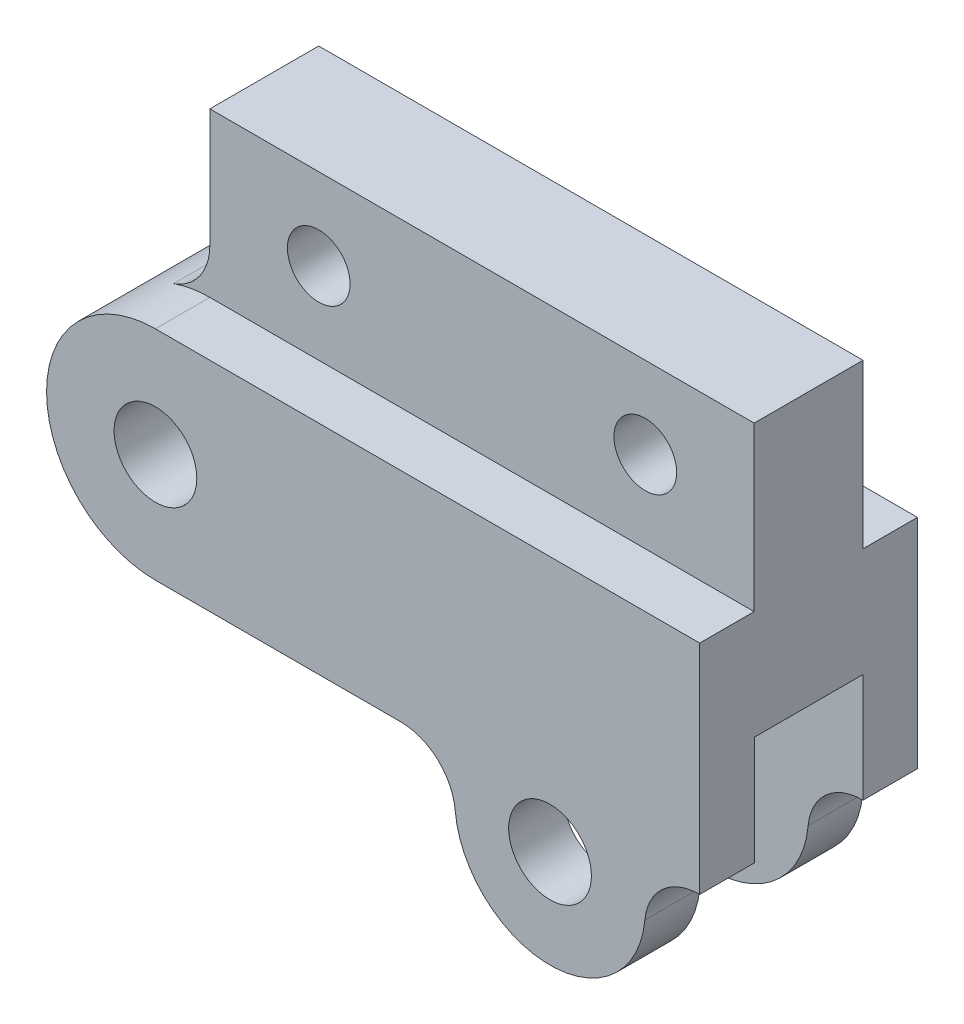
ISO-10303-21;
HEADER;
FILE_DESCRIPTION(('STEP AP214'),'2;1');
FILE_NAME('part.step','',(''),(''),'','','');
FILE_SCHEMA(('AUTOMOTIVE_DESIGN { 1 0 10303 214 1 1 1 1 }'));
ENDSEC;
DATA;
#1=APPLICATION_CONTEXT('core data for automotive mechanical design processes');
#2=APPLICATION_PROTOCOL_DEFINITION('international standard','automotive_design',2000,#1);
#3=PRODUCT_CONTEXT('',#1,'mechanical');
#4=PRODUCT('Part','Part','',(#3));
#5=PRODUCT_RELATED_PRODUCT_CATEGORY('part','',(#4));
#6=PRODUCT_DEFINITION_FORMATION('','',#4);
#7=PRODUCT_DEFINITION_CONTEXT('part definition',#1,'design');
#8=PRODUCT_DEFINITION('design','',#6,#7);
#9=PRODUCT_DEFINITION_SHAPE('','',#8);
#10=(LENGTH_UNIT() NAMED_UNIT(*) SI_UNIT(.MILLI.,.METRE.));
#11=(NAMED_UNIT(*) PLANE_ANGLE_UNIT() SI_UNIT($,.RADIAN.));
#12=(NAMED_UNIT(*) SI_UNIT($,.STERADIAN.) SOLID_ANGLE_UNIT());
#13=UNCERTAINTY_MEASURE_WITH_UNIT(LENGTH_MEASURE(1.E-05),#10,'distance_accuracy_value','');
#14=(GEOMETRIC_REPRESENTATION_CONTEXT(3) GLOBAL_UNCERTAINTY_ASSIGNED_CONTEXT((#13)) GLOBAL_UNIT_ASSIGNED_CONTEXT((#10,
#11,#12)) REPRESENTATION_CONTEXT('',''));
#15=CARTESIAN_POINT('',(0.,0.,0.));
#16=DIRECTION('',(0.,0.,1.));
#17=DIRECTION('',(1.,0.,0.));
#18=AXIS2_PLACEMENT_3D('',#15,#16,#17);
#19=CARTESIAN_POINT('',(-12.7,0.,-6.35));
#20=DIRECTION('',(0.,0.,-1.));
#21=DIRECTION('',(-1.,0.,0.));
#22=AXIS2_PLACEMENT_3D('',#19,#20,#21);
#23=CYLINDRICAL_SURFACE('',#22,6.35);
#24=DIRECTION('',(0.,0.,-1.));
#25=VECTOR('',#24,1.);
#26=CARTESIAN_POINT('',(-14.8166666666667,5.9868374140461,-6.35));
#27=LINE('',#26,#25);
#28=CARTESIAN_POINT('',(-14.8166666666667,5.9868374140461,3.175));
#29=VERTEX_POINT('',#28);
#30=CARTESIAN_POINT('',(-14.8166666666667,5.9868374140461,-3.175));
#31=VERTEX_POINT('',#30);
#32=EDGE_CURVE('E353',#29,#31,#27,.T.);
#33=ORIENTED_EDGE('',*,*,#32,.T.);
#34=CARTESIAN_POINT('',(-12.7,0.,-3.175));
#35=DIRECTION('',(0.,0.,1.));
#36=DIRECTION('',(1.,0.,0.));
#37=AXIS2_PLACEMENT_3D('',#34,#35,#36);
#38=CIRCLE('',#37,6.35);
#39=CARTESIAN_POINT('',(-12.7,6.35,-3.175));
#40=VERTEX_POINT('',#39);
#41=EDGE_CURVE('E356',#31,#40,#38,.F.);
#42=ORIENTED_EDGE('',*,*,#41,.T.);
#43=DIRECTION('',(0.,0.,-1.));
#44=VECTOR('',#43,1.);
#45=CARTESIAN_POINT('',(-12.7,6.35,6.35));
#46=LINE('',#45,#44);
#47=CARTESIAN_POINT('',(-12.7,6.35,-6.35));
#48=VERTEX_POINT('',#47);
#49=EDGE_CURVE('E342',#48,#40,#46,.F.);
#50=ORIENTED_EDGE('',*,*,#49,.F.);
#51=CARTESIAN_POINT('',(-12.7,0.,-6.35));
#52=DIRECTION('',(0.,0.,1.));
#53=DIRECTION('',(1.,0.,0.));
#54=AXIS2_PLACEMENT_3D('',#51,#52,#53);
#55=CIRCLE('',#54,6.35);
#56=CARTESIAN_POINT('',(-12.7,-6.35,-6.35));
#57=VERTEX_POINT('',#56);
#58=EDGE_CURVE('E348',#57,#48,#55,.F.);
#59=ORIENTED_EDGE('',*,*,#58,.F.);
#60=DIRECTION('',(0.,0.,1.));
#61=VECTOR('',#60,1.);
#62=CARTESIAN_POINT('',(-12.7,-6.35,-6.35));
#63=LINE('',#62,#61);
#64=CARTESIAN_POINT('',(-12.7,-6.35,6.35));
#65=VERTEX_POINT('',#64);
#66=EDGE_CURVE('E345',#65,#57,#63,.F.);
#67=ORIENTED_EDGE('',*,*,#66,.F.);
#68=CARTESIAN_POINT('',(-12.7,0.,6.35));
#69=DIRECTION('',(0.,0.,1.));
#70=DIRECTION('',(1.,0.,0.));
#71=AXIS2_PLACEMENT_3D('',#68,#69,#70);
#72=CIRCLE('',#71,6.35);
#73=CARTESIAN_POINT('',(-12.7,6.35,6.35));
#74=VERTEX_POINT('',#73);
#75=EDGE_CURVE('E350',#74,#65,#72,.T.);
#76=ORIENTED_EDGE('',*,*,#75,.F.);
#77=DIRECTION('',(0.,0.,-1.));
#78=VECTOR('',#77,1.);
#79=CARTESIAN_POINT('',(-12.7,6.35,6.35));
#80=LINE('',#79,#78);
#81=CARTESIAN_POINT('',(-12.7,6.35,3.175));
#82=VERTEX_POINT('',#81);
#83=EDGE_CURVE('E339',#82,#74,#80,.F.);
#84=ORIENTED_EDGE('',*,*,#83,.F.);
#85=CARTESIAN_POINT('',(-12.7,0.,3.175));
#86=DIRECTION('',(0.,0.,1.));
#87=DIRECTION('',(1.,0.,0.));
#88=AXIS2_PLACEMENT_3D('',#85,#86,#87);
#89=CIRCLE('',#88,6.35);
#90=EDGE_CURVE('E52',#82,#29,#89,.T.);
#91=ORIENTED_EDGE('',*,*,#90,.T.);
#92=EDGE_LOOP('',(#33,#42,#50,#59,#67,#76,#84,#91));
#93=FACE_BOUND('',#92,.T.);
#94=ADVANCED_FACE('F38',(#93),#23,.T.);
#95=CARTESIAN_POINT('',(0.,6.35,6.35));
#96=DIRECTION('',(0.,-1.,0.));
#97=DIRECTION('',(0.,0.,-1.));
#98=AXIS2_PLACEMENT_3D('',#95,#96,#97);
#99=PLANE('',#98);
#100=DIRECTION('',(-1.,0.,0.));
#101=VECTOR('',#100,1.);
#102=CARTESIAN_POINT('',(0.,6.35,-6.35));
#103=LINE('',#102,#101);
#104=CARTESIAN_POINT('',(19.05,6.35,-6.35));
#105=VERTEX_POINT('',#104);
#106=EDGE_CURVE('E410',#105,#48,#103,.T.);
#107=ORIENTED_EDGE('',*,*,#106,.T.);
#108=ORIENTED_EDGE('',*,*,#49,.T.);
#109=DIRECTION('',(1.,0.,0.));
#110=VECTOR('',#109,1.);
#111=CARTESIAN_POINT('',(19.05,6.35,-3.175));
#112=LINE('',#111,#110);
#113=CARTESIAN_POINT('',(19.05,6.35,-3.175));
#114=VERTEX_POINT('',#113);
#115=EDGE_CURVE('E267',#40,#114,#112,.T.);
#116=ORIENTED_EDGE('',*,*,#115,.T.);
#117=DIRECTION('',(0.,0.,-1.));
#118=VECTOR('',#117,1.);
#119=CARTESIAN_POINT('',(19.05,6.35,6.35));
#120=LINE('',#119,#118);
#121=EDGE_CURVE('E386',#114,#105,#120,.T.);
#122=ORIENTED_EDGE('',*,*,#121,.T.);
#123=EDGE_LOOP('',(#107,#108,#116,#122));
#124=FACE_BOUND('',#123,.T.);
#125=ADVANCED_FACE('F452',(#124),#99,.F.);
#126=CARTESIAN_POINT('',(10.31875,-8.73125,-6.35));
#127=DIRECTION('',(0.,0.,-1.));
#128=DIRECTION('',(-1.,0.,0.));
#129=AXIS2_PLACEMENT_3D('',#126,#127,#128);
#130=CYLINDRICAL_SURFACE('',#129,5.55625);
#131=CARTESIAN_POINT('',(10.31875,-8.73125,-3.175));
#132=DIRECTION('',(0.,0.,1.));
#133=DIRECTION('',(1.,0.,0.));
#134=AXIS2_PLACEMENT_3D('',#131,#132,#133);
#135=CIRCLE('',#134,5.55625);
#136=CARTESIAN_POINT('',(4.7855073452035,-9.23636363636363,-3.175));
#137=VERTEX_POINT('',#136);
#138=CARTESIAN_POINT('',(15.8519926547965,-9.23636363636363,-3.175));
#139=VERTEX_POINT('',#138);
#140=EDGE_CURVE('E300',#137,#139,#135,.T.);
#141=ORIENTED_EDGE('',*,*,#140,.F.);
#142=DIRECTION('',(0.,0.,-1.));
#143=VECTOR('',#142,1.);
#144=CARTESIAN_POINT('',(4.7855073452035,-9.23636363636363,-6.35));
#145=LINE('',#144,#143);
#146=CARTESIAN_POINT('',(4.7855073452035,-9.23636363636363,-6.35));
#147=VERTEX_POINT('',#146);
#148=EDGE_CURVE('E314',#137,#147,#145,.T.);
#149=ORIENTED_EDGE('',*,*,#148,.T.);
#150=CARTESIAN_POINT('',(10.31875,-8.73125,-6.35));
#151=DIRECTION('',(0.,0.,1.));
#152=DIRECTION('',(1.,0.,0.));
#153=AXIS2_PLACEMENT_3D('',#150,#151,#152);
#154=CIRCLE('',#153,5.55625);
#155=CARTESIAN_POINT('',(15.8519926547965,-9.23636363636363,-6.35));
#156=VERTEX_POINT('',#155);
#157=EDGE_CURVE('E297',#156,#147,#154,.F.);
#158=ORIENTED_EDGE('',*,*,#157,.F.);
#159=DIRECTION('',(0.,0.,-1.));
#160=VECTOR('',#159,1.);
#161=CARTESIAN_POINT('',(15.8519926547965,-9.23636363636363,-6.35));
#162=LINE('',#161,#160);
#163=EDGE_CURVE('E312',#156,#139,#162,.F.);
#164=ORIENTED_EDGE('',*,*,#163,.T.);
#165=EDGE_LOOP('',(#141,#149,#158,#164));
#166=FACE_BOUND('',#165,.T.);
#167=ADVANCED_FACE('F464',(#166),#130,.T.);
#168=CARTESIAN_POINT('',(10.31875,-8.73125,3.1496));
#169=DIRECTION('',(0.,0.,-1.));
#170=DIRECTION('',(-1.,0.,0.));
#171=AXIS2_PLACEMENT_3D('',#168,#169,#170);
#172=CYLINDRICAL_SURFACE('',#171,5.55625);
#173=CARTESIAN_POINT('',(10.31875,-8.73125,6.35));
#174=DIRECTION('',(0.,0.,1.));
#175=DIRECTION('',(1.,0.,0.));
#176=AXIS2_PLACEMENT_3D('',#173,#174,#175);
#177=CIRCLE('',#176,5.55625);
#178=CARTESIAN_POINT('',(4.7855073452035,-9.23636363636363,6.35));
#179=VERTEX_POINT('',#178);
#180=CARTESIAN_POINT('',(15.8519926547965,-9.23636363636363,6.35));
#181=VERTEX_POINT('',#180);
#182=EDGE_CURVE('E294',#179,#181,#177,.T.);
#183=ORIENTED_EDGE('',*,*,#182,.F.);
#184=DIRECTION('',(0.,0.,-1.));
#185=VECTOR('',#184,1.);
#186=CARTESIAN_POINT('',(4.7855073452035,-9.23636363636363,3.1496));
#187=LINE('',#186,#185);
#188=CARTESIAN_POINT('',(4.7855073452035,-9.23636363636363,3.1496));
#189=VERTEX_POINT('',#188);
#190=EDGE_CURVE('E305',#179,#189,#187,.T.);
#191=ORIENTED_EDGE('',*,*,#190,.T.);
#192=CARTESIAN_POINT('',(10.31875,-8.73125,3.1496));
#193=DIRECTION('',(0.,0.,1.));
#194=DIRECTION('',(1.,0.,0.));
#195=AXIS2_PLACEMENT_3D('',#192,#193,#194);
#196=CIRCLE('',#195,5.55625);
#197=CARTESIAN_POINT('',(15.8519926547965,-9.23636363636363,3.1496));
#198=VERTEX_POINT('',#197);
#199=EDGE_CURVE('E291',#198,#189,#196,.F.);
#200=ORIENTED_EDGE('',*,*,#199,.F.);
#201=DIRECTION('',(0.,0.,-1.));
#202=VECTOR('',#201,1.);
#203=CARTESIAN_POINT('',(15.8519926547965,-9.23636363636363,3.1496));
#204=LINE('',#203,#202);
#205=EDGE_CURVE('E303',#198,#181,#204,.F.);
#206=ORIENTED_EDGE('',*,*,#205,.T.);
#207=EDGE_LOOP('',(#183,#191,#200,#206));
#208=FACE_BOUND('',#207,.T.);
#209=ADVANCED_FACE('F434',(#208),#172,.T.);
#210=CARTESIAN_POINT('',(0.,-6.35,6.35));
#211=DIRECTION('',(0.,-1.,0.));
#212=DIRECTION('',(0.,0.,-1.));
#213=AXIS2_PLACEMENT_3D('',#210,#211,#212);
#214=PLANE('',#213);
#215=DIRECTION('',(-1.,0.,0.));
#216=VECTOR('',#215,1.);
#217=CARTESIAN_POINT('',(0.,-6.35,-3.175));
#218=LINE('',#217,#216);
#219=CARTESIAN_POINT('',(19.05,-6.35,-3.175));
#220=VERTEX_POINT('',#219);
#221=CARTESIAN_POINT('',(19.0138456003945,-6.35,-3.175));
#222=VERTEX_POINT('',#221);
#223=EDGE_CURVE('E231',#220,#222,#218,.T.);
#224=ORIENTED_EDGE('',*,*,#223,.T.);
#225=DIRECTION('',(0.,0.,1.));
#226=VECTOR('',#225,1.);
#227=CARTESIAN_POINT('',(19.0138456003945,-6.35,-6.35));
#228=LINE('',#227,#226);
#229=CARTESIAN_POINT('',(19.0138456003945,-6.35,-6.35));
#230=VERTEX_POINT('',#229);
#231=EDGE_CURVE('E320',#222,#230,#228,.F.);
#232=ORIENTED_EDGE('',*,*,#231,.T.);
#233=DIRECTION('',(-1.,0.,0.));
#234=VECTOR('',#233,1.);
#235=CARTESIAN_POINT('',(0.,-6.35,-6.35));
#236=LINE('',#235,#234);
#237=CARTESIAN_POINT('',(19.05,-6.35,-6.35));
#238=VERTEX_POINT('',#237);
#239=EDGE_CURVE('E394',#238,#230,#236,.T.);
#240=ORIENTED_EDGE('',*,*,#239,.F.);
#241=DIRECTION('',(0.,0.,-1.));
#242=VECTOR('',#241,1.);
#243=CARTESIAN_POINT('',(19.05,-6.35,6.35));
#244=LINE('',#243,#242);
#245=EDGE_CURVE('E415',#220,#238,#244,.T.);
#246=ORIENTED_EDGE('',*,*,#245,.F.);
#247=EDGE_LOOP('',(#224,#232,#240,#246));
#248=FACE_BOUND('',#247,.T.);
#249=ADVANCED_FACE('F446',(#248),#214,.T.);
#250=CARTESIAN_POINT('',(19.05,0.,6.35));
#251=DIRECTION('',(-1.,0.,0.));
#252=DIRECTION('',(0.,0.,1.));
#253=AXIS2_PLACEMENT_3D('',#250,#251,#252);
#254=PLANE('',#253);
#255=DIRECTION('',(0.,-1.,0.));
#256=VECTOR('',#255,1.);
#257=CARTESIAN_POINT('',(19.05,-14.2875,-3.175));
#258=LINE('',#257,#256);
#259=CARTESIAN_POINT('',(19.05,0.,-3.175));
#260=VERTEX_POINT('',#259);
#261=EDGE_CURVE('E217',#260,#220,#258,.T.);
#262=ORIENTED_EDGE('',*,*,#261,.T.);
#263=ORIENTED_EDGE('',*,*,#245,.T.);
#264=DIRECTION('',(0.,1.,0.));
#265=VECTOR('',#264,1.);
#266=CARTESIAN_POINT('',(19.05,0.,-6.35));
#267=LINE('',#266,#265);
#268=EDGE_CURVE('E396',#238,#105,#267,.T.);
#269=ORIENTED_EDGE('',*,*,#268,.T.);
#270=ORIENTED_EDGE('',*,*,#121,.F.);
#271=DIRECTION('',(0.,1.,0.));
#272=VECTOR('',#271,1.);
#273=CARTESIAN_POINT('',(19.05,6.35,-3.175));
#274=LINE('',#273,#272);
#275=CARTESIAN_POINT('',(19.05,15.875,-3.175));
#276=VERTEX_POINT('',#275);
#277=EDGE_CURVE('E256',#114,#276,#274,.T.);
#278=ORIENTED_EDGE('',*,*,#277,.T.);
#279=DIRECTION('',(0.,0.,-1.));
#280=VECTOR('',#279,1.);
#281=CARTESIAN_POINT('',(19.05,15.875,3.175));
#282=LINE('',#281,#280);
#283=CARTESIAN_POINT('',(19.05,15.875,3.175));
#284=VERTEX_POINT('',#283);
#285=EDGE_CURVE('E383',#284,#276,#282,.T.);
#286=ORIENTED_EDGE('',*,*,#285,.F.);
#287=DIRECTION('',(0.,1.,0.));
#288=VECTOR('',#287,1.);
#289=CARTESIAN_POINT('',(19.05,6.35,3.175));
#290=LINE('',#289,#288);
#291=CARTESIAN_POINT('',(19.05,6.35,3.175));
#292=VERTEX_POINT('',#291);
#293=EDGE_CURVE('E260',#292,#284,#290,.T.);
#294=ORIENTED_EDGE('',*,*,#293,.F.);
#295=CARTESIAN_POINT('',(19.05,6.35,6.35));
#296=VERTEX_POINT('',#295);
#297=EDGE_CURVE('E380',#296,#292,#120,.T.);
#298=ORIENTED_EDGE('',*,*,#297,.F.);
#299=DIRECTION('',(0.,1.,0.));
#300=VECTOR('',#299,1.);
#301=CARTESIAN_POINT('',(19.05,0.,6.35));
#302=LINE('',#301,#300);
#303=CARTESIAN_POINT('',(19.05,-6.35,6.35));
#304=VERTEX_POINT('',#303);
#305=EDGE_CURVE('E403',#304,#296,#302,.T.);
#306=ORIENTED_EDGE('',*,*,#305,.F.);
#307=CARTESIAN_POINT('',(19.05,-6.35,3.1496));
#308=VERTEX_POINT('',#307);
#309=EDGE_CURVE('E213',#304,#308,#244,.T.);
#310=ORIENTED_EDGE('',*,*,#309,.T.);
#311=DIRECTION('',(0.,1.,0.));
#312=VECTOR('',#311,1.);
#313=CARTESIAN_POINT('',(19.05,-14.2875,3.1496));
#314=LINE('',#313,#312);
#315=CARTESIAN_POINT('',(19.05,0.,3.14960000000001));
#316=VERTEX_POINT('',#315);
#317=EDGE_CURVE('E200',#308,#316,#314,.T.);
#318=ORIENTED_EDGE('',*,*,#317,.T.);
#319=DIRECTION('',(0.,0.,1.));
#320=VECTOR('',#319,1.);
#321=CARTESIAN_POINT('',(19.05,0.,-28.9126142656386));
#322=LINE('',#321,#320);
#323=EDGE_CURVE('E188',#260,#316,#322,.T.);
#324=ORIENTED_EDGE('',*,*,#323,.F.);
#325=EDGE_LOOP('',(#262,#263,#269,#270,#278,#286,#294,#298,#306,#310,#318,#324));
#326=FACE_BOUND('',#325,.T.);
#327=ADVANCED_FACE('F211',(#326),#254,.F.);
#328=DIRECTION('',(-1.,0.,0.));
#329=VECTOR('',#328,1.);
#330=CARTESIAN_POINT('',(0.,-6.35,6.35));
#331=LINE('',#330,#329);
#332=CARTESIAN_POINT('',(1.62365439960549,-6.35,6.35));
#333=VERTEX_POINT('',#332);
#334=EDGE_CURVE('E404',#333,#65,#331,.T.);
#335=ORIENTED_EDGE('',*,*,#334,.T.);
#336=ORIENTED_EDGE('',*,*,#66,.T.);
#337=CARTESIAN_POINT('',(1.62365439960549,-6.35,-6.35));
#338=VERTEX_POINT('',#337);
#339=EDGE_CURVE('E398',#338,#57,#236,.T.);
#340=ORIENTED_EDGE('',*,*,#339,.F.);
#341=DIRECTION('',(0.,0.,1.));
#342=VECTOR('',#341,1.);
#343=CARTESIAN_POINT('',(1.62365439960549,-6.35,-3.175));
#344=LINE('',#343,#342);
#345=CARTESIAN_POINT('',(1.62365439960549,-6.35,-3.175));
#346=VERTEX_POINT('',#345);
#347=EDGE_CURVE('E308',#338,#346,#344,.T.);
#348=ORIENTED_EDGE('',*,*,#347,.T.);
#349=DIRECTION('',(-1.,0.,0.));
#350=VECTOR('',#349,1.);
#351=CARTESIAN_POINT('',(0.,-6.35,-3.175));
#352=LINE('',#351,#350);
#353=CARTESIAN_POINT('',(1.5875,-6.35,-3.175));
#354=VERTEX_POINT('',#353);
#355=EDGE_CURVE('E229',#346,#354,#352,.T.);
#356=ORIENTED_EDGE('',*,*,#355,.T.);
#357=DIRECTION('',(0.,0.,-1.));
#358=VECTOR('',#357,1.);
#359=CARTESIAN_POINT('',(1.5875,-6.35,6.35));
#360=LINE('',#359,#358);
#361=CARTESIAN_POINT('',(1.5875,-6.35,3.1496));
#362=VERTEX_POINT('',#361);
#363=EDGE_CURVE('E288',#362,#354,#360,.T.);
#364=ORIENTED_EDGE('',*,*,#363,.F.);
#365=DIRECTION('',(-1.,0.,0.));
#366=VECTOR('',#365,1.);
#367=CARTESIAN_POINT('',(0.,-6.35,3.1496));
#368=LINE('',#367,#366);
#369=CARTESIAN_POINT('',(1.62365439960549,-6.35,3.1496));
#370=VERTEX_POINT('',#369);
#371=EDGE_CURVE('E224',#370,#362,#368,.T.);
#372=ORIENTED_EDGE('',*,*,#371,.F.);
#373=DIRECTION('',(0.,0.,1.));
#374=VECTOR('',#373,1.);
#375=CARTESIAN_POINT('',(1.62365439960549,-6.35,6.35));
#376=LINE('',#375,#374);
#377=EDGE_CURVE('E310',#370,#333,#376,.T.);
#378=ORIENTED_EDGE('',*,*,#377,.T.);
#379=EDGE_LOOP('',(#335,#336,#340,#348,#356,#364,#372,#378));
#380=FACE_BOUND('',#379,.T.);
#381=ADVANCED_FACE('F420',(#380),#214,.T.);
#382=CARTESIAN_POINT('',(10.31875,-8.5725,6.35));
#383=DIRECTION('',(0.,0.,1.));
#384=DIRECTION('',(1.,0.,0.));
#385=AXIS2_PLACEMENT_3D('',#382,#383,#384);
#386=CYLINDRICAL_SURFACE('',#385,2.413);
#387=CARTESIAN_POINT('',(10.31875,-8.5725,-6.35));
#388=DIRECTION('',(0.,0.,1.));
#389=DIRECTION('',(1.,0.,0.));
#390=AXIS2_PLACEMENT_3D('',#387,#388,#389);
#391=CIRCLE('',#390,2.413);
#392=CARTESIAN_POINT('',(12.73175,-8.5725,-6.35));
#393=VERTEX_POINT('',#392);
#394=EDGE_CURVE('E241',#393,#393,#391,.T.);
#395=ORIENTED_EDGE('',*,*,#394,.F.);
#396=EDGE_LOOP('',(#395));
#397=FACE_BOUND('',#396,.T.);
#398=CARTESIAN_POINT('',(10.31875,-8.5725,-3.175));
#399=DIRECTION('',(0.,0.,1.));
#400=DIRECTION('',(1.,0.,0.));
#401=AXIS2_PLACEMENT_3D('',#398,#399,#400);
#402=CIRCLE('',#401,2.413);
#403=CARTESIAN_POINT('',(12.73175,-8.5725,-3.175));
#404=VERTEX_POINT('',#403);
#405=EDGE_CURVE('E228',#404,#404,#402,.F.);
#406=ORIENTED_EDGE('',*,*,#405,.F.);
#407=EDGE_LOOP('',(#406));
#408=FACE_BOUND('',#407,.T.);
#409=ADVANCED_FACE('F444',(#397,#408),#386,.F.);
#410=CARTESIAN_POINT('',(19.0138456003945,-6.35,6.35));
#411=VERTEX_POINT('',#410);
#412=EDGE_CURVE('E400',#304,#411,#331,.T.);
#413=ORIENTED_EDGE('',*,*,#412,.T.);
#414=DIRECTION('',(0.,0.,1.));
#415=VECTOR('',#414,1.);
#416=CARTESIAN_POINT('',(19.0138456003945,-6.35,3.1496));
#417=LINE('',#416,#415);
#418=CARTESIAN_POINT('',(19.0138456003945,-6.35,3.1496));
#419=VERTEX_POINT('',#418);
#420=EDGE_CURVE('E317',#411,#419,#417,.F.);
#421=ORIENTED_EDGE('',*,*,#420,.T.);
#422=DIRECTION('',(-1.,0.,0.));
#423=VECTOR('',#422,1.);
#424=CARTESIAN_POINT('',(0.,-6.35,3.1496));
#425=LINE('',#424,#423);
#426=EDGE_CURVE('E226',#308,#419,#425,.T.);
#427=ORIENTED_EDGE('',*,*,#426,.F.);
#428=ORIENTED_EDGE('',*,*,#309,.F.);
#429=EDGE_LOOP('',(#413,#421,#427,#428));
#430=FACE_BOUND('',#429,.T.);
#431=ADVANCED_FACE('F441',(#430),#214,.T.);
#432=DIRECTION('',(1.,0.,0.));
#433=VECTOR('',#432,1.);
#434=CARTESIAN_POINT('',(19.05,6.35,3.175));
#435=LINE('',#434,#433);
#436=EDGE_CURVE('E262',#82,#292,#435,.T.);
#437=ORIENTED_EDGE('',*,*,#436,.F.);
#438=ORIENTED_EDGE('',*,*,#83,.T.);
#439=DIRECTION('',(-1.,0.,0.));
#440=VECTOR('',#439,1.);
#441=CARTESIAN_POINT('',(0.,6.35,6.35));
#442=LINE('',#441,#440);
#443=EDGE_CURVE('E406',#296,#74,#442,.T.);
#444=ORIENTED_EDGE('',*,*,#443,.F.);
#445=ORIENTED_EDGE('',*,*,#297,.T.);
#446=EDGE_LOOP('',(#437,#438,#444,#445));
#447=FACE_BOUND('',#446,.T.);
#448=ADVANCED_FACE('F378',(#447),#99,.F.);
#449=CARTESIAN_POINT('',(0.,0.,6.35));
#450=DIRECTION('',(0.,0.,1.));
#451=DIRECTION('',(1.,0.,0.));
#452=AXIS2_PLACEMENT_3D('',#449,#450,#451);
#453=PLANE('',#452);
#454=CARTESIAN_POINT('',(-12.7,0.,6.35));
#455=DIRECTION('',(0.,0.,1.));
#456=DIRECTION('',(1.,0.,0.));
#457=AXIS2_PLACEMENT_3D('',#454,#455,#456);
#458=CIRCLE('',#457,2.413);
#459=CARTESIAN_POINT('',(-10.287,0.,6.35));
#460=VERTEX_POINT('',#459);
#461=EDGE_CURVE('E234',#460,#460,#458,.T.);
#462=ORIENTED_EDGE('',*,*,#461,.F.);
#463=EDGE_LOOP('',(#462));
#464=FACE_BOUND('',#463,.T.);
#465=CARTESIAN_POINT('',(10.31875,-8.5725,6.35));
#466=DIRECTION('',(0.,0.,1.));
#467=DIRECTION('',(1.,0.,0.));
#468=AXIS2_PLACEMENT_3D('',#465,#466,#467);
#469=CIRCLE('',#468,2.413);
#470=CARTESIAN_POINT('',(12.73175,-8.5725,6.35));
#471=VERTEX_POINT('',#470);
#472=EDGE_CURVE('E238',#471,#471,#469,.T.);
#473=ORIENTED_EDGE('',*,*,#472,.F.);
#474=EDGE_LOOP('',(#473));
#475=FACE_BOUND('',#474,.T.);
#476=ORIENTED_EDGE('',*,*,#443,.T.);
#477=ORIENTED_EDGE('',*,*,#75,.T.);
#478=ORIENTED_EDGE('',*,*,#334,.F.);
#479=CARTESIAN_POINT('',(1.62365439960549,-9.525,6.35));
#480=DIRECTION('',(0.,0.,1.));
#481=DIRECTION('',(1.,0.,0.));
#482=AXIS2_PLACEMENT_3D('',#479,#480,#481);
#483=CIRCLE('',#482,3.175);
#484=EDGE_CURVE('E325',#333,#179,#483,.F.);
#485=ORIENTED_EDGE('',*,*,#484,.T.);
#486=ORIENTED_EDGE('',*,*,#182,.T.);
#487=CARTESIAN_POINT('',(19.0138456003945,-9.525,6.35));
#488=DIRECTION('',(0.,0.,1.));
#489=DIRECTION('',(1.,0.,0.));
#490=AXIS2_PLACEMENT_3D('',#487,#488,#489);
#491=CIRCLE('',#490,3.175);
#492=EDGE_CURVE('E333',#181,#411,#491,.F.);
#493=ORIENTED_EDGE('',*,*,#492,.T.);
#494=ORIENTED_EDGE('',*,*,#412,.F.);
#495=ORIENTED_EDGE('',*,*,#305,.T.);
#496=EDGE_LOOP('',(#476,#477,#478,#485,#486,#493,#494,#495));
#497=FACE_BOUND('',#496,.T.);
#498=ADVANCED_FACE('F427',(#464,#475,#497),#453,.T.);
#499=CARTESIAN_POINT('',(0.,0.,-6.35));
#500=DIRECTION('',(0.,0.,1.));
#501=DIRECTION('',(1.,0.,0.));
#502=AXIS2_PLACEMENT_3D('',#499,#500,#501);
#503=PLANE('',#502);
#504=CARTESIAN_POINT('',(-12.7,0.,-6.35));
#505=DIRECTION('',(0.,0.,1.));
#506=DIRECTION('',(1.,0.,0.));
#507=AXIS2_PLACEMENT_3D('',#504,#505,#506);
#508=CIRCLE('',#507,2.413);
#509=CARTESIAN_POINT('',(-10.287,0.,-6.35));
#510=VERTEX_POINT('',#509);
#511=EDGE_CURVE('E237',#510,#510,#508,.T.);
#512=ORIENTED_EDGE('',*,*,#511,.T.);
#513=EDGE_LOOP('',(#512));
#514=FACE_BOUND('',#513,.T.);
#515=ORIENTED_EDGE('',*,*,#394,.T.);
#516=EDGE_LOOP('',(#515));
#517=FACE_BOUND('',#516,.T.);
#518=ORIENTED_EDGE('',*,*,#339,.T.);
#519=ORIENTED_EDGE('',*,*,#58,.T.);
#520=ORIENTED_EDGE('',*,*,#106,.F.);
#521=ORIENTED_EDGE('',*,*,#268,.F.);
#522=ORIENTED_EDGE('',*,*,#239,.T.);
#523=CARTESIAN_POINT('',(19.0138456003945,-9.525,-6.35));
#524=DIRECTION('',(0.,0.,1.));
#525=DIRECTION('',(1.,0.,0.));
#526=AXIS2_PLACEMENT_3D('',#523,#524,#525);
#527=CIRCLE('',#526,3.175);
#528=EDGE_CURVE('E335',#230,#156,#527,.T.);
#529=ORIENTED_EDGE('',*,*,#528,.T.);
#530=ORIENTED_EDGE('',*,*,#157,.T.);
#531=CARTESIAN_POINT('',(1.62365439960549,-9.525,-6.35));
#532=DIRECTION('',(0.,0.,1.));
#533=DIRECTION('',(1.,0.,0.));
#534=AXIS2_PLACEMENT_3D('',#531,#532,#533);
#535=CIRCLE('',#534,3.175);
#536=EDGE_CURVE('E327',#147,#338,#535,.T.);
#537=ORIENTED_EDGE('',*,*,#536,.T.);
#538=EDGE_LOOP('',(#518,#519,#520,#521,#522,#529,#530,#537));
#539=FACE_BOUND('',#538,.T.);
#540=ADVANCED_FACE('F651',(#514,#517,#539),#503,.F.);
#541=CARTESIAN_POINT('',(19.05,15.875,3.175));
#542=DIRECTION('',(0.,-1.,0.));
#543=DIRECTION('',(1.,0.,0.));
#544=AXIS2_PLACEMENT_3D('',#541,#542,#543);
#545=PLANE('',#544);
#546=DIRECTION('',(-1.,0.,0.));
#547=VECTOR('',#546,1.);
#548=CARTESIAN_POINT('',(19.05,15.875,-3.175));
#549=LINE('',#548,#547);
#550=CARTESIAN_POINT('',(-12.7,15.875,-3.175));
#551=VERTEX_POINT('',#550);
#552=EDGE_CURVE('E263',#276,#551,#549,.T.);
#553=ORIENTED_EDGE('',*,*,#552,.T.);
#554=DIRECTION('',(0.,0.,-1.));
#555=VECTOR('',#554,1.);
#556=CARTESIAN_POINT('',(-12.7,15.875,3.175));
#557=LINE('',#556,#555);
#558=CARTESIAN_POINT('',(-12.7,15.875,3.175));
#559=VERTEX_POINT('',#558);
#560=EDGE_CURVE('E270',#559,#551,#557,.T.);
#561=ORIENTED_EDGE('',*,*,#560,.F.);
#562=DIRECTION('',(-1.,0.,0.));
#563=VECTOR('',#562,1.);
#564=CARTESIAN_POINT('',(19.05,15.875,3.175));
#565=LINE('',#564,#563);
#566=EDGE_CURVE('E257',#284,#559,#565,.T.);
#567=ORIENTED_EDGE('',*,*,#566,.F.);
#568=ORIENTED_EDGE('',*,*,#285,.T.);
#569=EDGE_LOOP('',(#553,#561,#567,#568));
#570=FACE_BOUND('',#569,.T.);
#571=ADVANCED_FACE('F641',(#570),#545,.F.);
#572=CARTESIAN_POINT('',(-12.7,6.35,3.175));
#573=DIRECTION('',(1.,0.,0.));
#574=DIRECTION('',(0.,0.,-1.));
#575=AXIS2_PLACEMENT_3D('',#572,#573,#574);
#576=PLANE('',#575);
#577=DIRECTION('',(0.,-1.,0.));
#578=VECTOR('',#577,1.);
#579=CARTESIAN_POINT('',(-12.7,6.35,-3.175));
#580=LINE('',#579,#578);
#581=CARTESIAN_POINT('',(-12.7,8.98025612106915,-3.175));
#582=VERTEX_POINT('',#581);
#583=EDGE_CURVE('E265',#551,#582,#580,.T.);
#584=ORIENTED_EDGE('',*,*,#583,.T.);
#585=DIRECTION('',(0.,0.,-1.));
#586=VECTOR('',#585,1.);
#587=CARTESIAN_POINT('',(-12.7,8.98025612106915,3.175));
#588=LINE('',#587,#586);
#589=CARTESIAN_POINT('',(-12.7,8.98025612106915,3.175));
#590=VERTEX_POINT('',#589);
#591=EDGE_CURVE('E60',#582,#590,#588,.F.);
#592=ORIENTED_EDGE('',*,*,#591,.T.);
#593=DIRECTION('',(0.,-1.,0.));
#594=VECTOR('',#593,1.);
#595=CARTESIAN_POINT('',(-12.7,6.35,3.175));
#596=LINE('',#595,#594);
#597=EDGE_CURVE('E259',#559,#590,#596,.T.);
#598=ORIENTED_EDGE('',*,*,#597,.F.);
#599=ORIENTED_EDGE('',*,*,#560,.T.);
#600=EDGE_LOOP('',(#584,#592,#598,#599));
#601=FACE_BOUND('',#600,.T.);
#602=ADVANCED_FACE('F366',(#601),#576,.F.);
#603=CARTESIAN_POINT('',(0.,0.,3.175));
#604=DIRECTION('',(0.,0.,1.));
#605=DIRECTION('',(1.,0.,0.));
#606=AXIS2_PLACEMENT_3D('',#603,#604,#605);
#607=PLANE('',#606);
#608=CARTESIAN_POINT('',(-6.35,11.1125,3.175));
#609=DIRECTION('',(0.,0.,1.));
#610=DIRECTION('',(1.,0.,0.));
#611=AXIS2_PLACEMENT_3D('',#608,#609,#610);
#612=CIRCLE('',#611,1.8288);
#613=CARTESIAN_POINT('',(-4.5212,11.1125,3.175));
#614=VERTEX_POINT('',#613);
#615=EDGE_CURVE('E244',#614,#614,#612,.T.);
#616=ORIENTED_EDGE('',*,*,#615,.F.);
#617=EDGE_LOOP('',(#616));
#618=FACE_BOUND('',#617,.T.);
#619=CARTESIAN_POINT('',(12.7,11.1125,3.175));
#620=DIRECTION('',(0.,0.,1.));
#621=DIRECTION('',(1.,0.,0.));
#622=AXIS2_PLACEMENT_3D('',#619,#620,#621);
#623=CIRCLE('',#622,1.8288);
#624=CARTESIAN_POINT('',(14.5288,11.1125,3.175));
#625=VERTEX_POINT('',#624);
#626=EDGE_CURVE('E250',#625,#625,#623,.T.);
#627=ORIENTED_EDGE('',*,*,#626,.F.);
#628=EDGE_LOOP('',(#627));
#629=FACE_BOUND('',#628,.T.);
#630=ORIENTED_EDGE('',*,*,#293,.T.);
#631=ORIENTED_EDGE('',*,*,#566,.T.);
#632=ORIENTED_EDGE('',*,*,#597,.T.);
#633=CARTESIAN_POINT('',(-15.875,8.98025612106915,3.175));
#634=DIRECTION('',(0.,0.,1.));
#635=DIRECTION('',(1.,0.,0.));
#636=AXIS2_PLACEMENT_3D('',#633,#634,#635);
#637=CIRCLE('',#636,3.175);
#638=EDGE_CURVE('E12',#590,#29,#637,.F.);
#639=ORIENTED_EDGE('',*,*,#638,.T.);
#640=ORIENTED_EDGE('',*,*,#90,.F.);
#641=ORIENTED_EDGE('',*,*,#436,.T.);
#642=EDGE_LOOP('',(#630,#631,#632,#639,#640,#641));
#643=FACE_BOUND('',#642,.T.);
#644=ADVANCED_FACE('F370',(#618,#629,#643),#607,.T.);
#645=CARTESIAN_POINT('',(0.,0.,-3.175));
#646=DIRECTION('',(0.,0.,1.));
#647=DIRECTION('',(1.,0.,0.));
#648=AXIS2_PLACEMENT_3D('',#645,#646,#647);
#649=PLANE('',#648);
#650=CARTESIAN_POINT('',(-6.35,11.1125,-3.175));
#651=DIRECTION('',(0.,0.,1.));
#652=DIRECTION('',(1.,0.,0.));
#653=AXIS2_PLACEMENT_3D('',#650,#651,#652);
#654=CIRCLE('',#653,1.8288);
#655=CARTESIAN_POINT('',(-4.5212,11.1125,-3.175));
#656=VERTEX_POINT('',#655);
#657=EDGE_CURVE('E247',#656,#656,#654,.T.);
#658=ORIENTED_EDGE('',*,*,#657,.T.);
#659=EDGE_LOOP('',(#658));
#660=FACE_BOUND('',#659,.T.);
#661=CARTESIAN_POINT('',(12.7,11.1125,-3.175));
#662=DIRECTION('',(0.,0.,1.));
#663=DIRECTION('',(1.,0.,0.));
#664=AXIS2_PLACEMENT_3D('',#661,#662,#663);
#665=CIRCLE('',#664,1.8288);
#666=CARTESIAN_POINT('',(14.5288,11.1125,-3.175));
#667=VERTEX_POINT('',#666);
#668=EDGE_CURVE('E253',#667,#667,#665,.T.);
#669=ORIENTED_EDGE('',*,*,#668,.T.);
#670=EDGE_LOOP('',(#669));
#671=FACE_BOUND('',#670,.T.);
#672=ORIENTED_EDGE('',*,*,#277,.F.);
#673=ORIENTED_EDGE('',*,*,#115,.F.);
#674=ORIENTED_EDGE('',*,*,#41,.F.);
#675=CARTESIAN_POINT('',(-15.875,8.98025612106915,-3.175));
#676=DIRECTION('',(0.,0.,1.));
#677=DIRECTION('',(1.,0.,0.));
#678=AXIS2_PLACEMENT_3D('',#675,#676,#677);
#679=CIRCLE('',#678,3.175);
#680=EDGE_CURVE('E46',#31,#582,#679,.T.);
#681=ORIENTED_EDGE('',*,*,#680,.T.);
#682=ORIENTED_EDGE('',*,*,#583,.F.);
#683=ORIENTED_EDGE('',*,*,#552,.F.);
#684=EDGE_LOOP('',(#672,#673,#674,#681,#682,#683));
#685=FACE_BOUND('',#684,.T.);
#686=ADVANCED_FACE('F361',(#660,#671,#685),#649,.F.);
#687=CARTESIAN_POINT('',(12.7,11.1125,3.175));
#688=DIRECTION('',(0.,0.,1.));
#689=DIRECTION('',(1.,0.,0.));
#690=AXIS2_PLACEMENT_3D('',#687,#688,#689);
#691=CYLINDRICAL_SURFACE('',#690,1.8288);
#692=ORIENTED_EDGE('',*,*,#626,.T.);
#693=EDGE_LOOP('',(#692));
#694=FACE_BOUND('',#693,.T.);
#695=ORIENTED_EDGE('',*,*,#668,.F.);
#696=EDGE_LOOP('',(#695));
#697=FACE_BOUND('',#696,.T.);
#698=ADVANCED_FACE('F622',(#694,#697),#691,.F.);
#699=CARTESIAN_POINT('',(-6.35,11.1125,3.175));
#700=DIRECTION('',(0.,0.,1.));
#701=DIRECTION('',(1.,0.,0.));
#702=AXIS2_PLACEMENT_3D('',#699,#700,#701);
#703=CYLINDRICAL_SURFACE('',#702,1.8288);
#704=ORIENTED_EDGE('',*,*,#615,.T.);
#705=EDGE_LOOP('',(#704));
#706=FACE_BOUND('',#705,.T.);
#707=ORIENTED_EDGE('',*,*,#657,.F.);
#708=EDGE_LOOP('',(#707));
#709=FACE_BOUND('',#708,.T.);
#710=ADVANCED_FACE('F510',(#706,#709),#703,.F.);
#711=CARTESIAN_POINT('',(10.31875,-8.5725,3.1496));
#712=DIRECTION('',(0.,0.,1.));
#713=DIRECTION('',(1.,0.,0.));
#714=AXIS2_PLACEMENT_3D('',#711,#712,#713);
#715=CIRCLE('',#714,2.413);
#716=CARTESIAN_POINT('',(12.73175,-8.5725,3.1496));
#717=VERTEX_POINT('',#716);
#718=EDGE_CURVE('E222',#717,#717,#715,.F.);
#719=ORIENTED_EDGE('',*,*,#718,.T.);
#720=EDGE_LOOP('',(#719));
#721=FACE_BOUND('',#720,.T.);
#722=ORIENTED_EDGE('',*,*,#472,.T.);
#723=EDGE_LOOP('',(#722));
#724=FACE_BOUND('',#723,.T.);
#725=ADVANCED_FACE('F455',(#721,#724),#386,.F.);
#726=CARTESIAN_POINT('',(-12.7,0.,6.35));
#727=DIRECTION('',(0.,0.,1.));
#728=DIRECTION('',(1.,0.,0.));
#729=AXIS2_PLACEMENT_3D('',#726,#727,#728);
#730=CYLINDRICAL_SURFACE('',#729,2.413);
#731=ORIENTED_EDGE('',*,*,#461,.T.);
#732=EDGE_LOOP('',(#731));
#733=FACE_BOUND('',#732,.T.);
#734=ORIENTED_EDGE('',*,*,#511,.F.);
#735=EDGE_LOOP('',(#734));
#736=FACE_BOUND('',#735,.T.);
#737=ADVANCED_FACE('F509',(#733,#736),#730,.F.);
#738=CARTESIAN_POINT('',(0.,0.,-3.175));
#739=DIRECTION('',(0.,0.,1.));
#740=DIRECTION('',(1.,0.,0.));
#741=AXIS2_PLACEMENT_3D('',#738,#739,#740);
#742=PLANE('',#741);
#743=ORIENTED_EDGE('',*,*,#405,.T.);
#744=EDGE_LOOP('',(#743));
#745=FACE_BOUND('',#744,.T.);
#746=ORIENTED_EDGE('',*,*,#355,.F.);
#747=CARTESIAN_POINT('',(1.62365439960549,-9.525,-3.175));
#748=DIRECTION('',(0.,0.,1.));
#749=DIRECTION('',(1.,0.,0.));
#750=AXIS2_PLACEMENT_3D('',#747,#748,#749);
#751=CIRCLE('',#750,3.175);
#752=EDGE_CURVE('E329',#346,#137,#751,.F.);
#753=ORIENTED_EDGE('',*,*,#752,.T.);
#754=ORIENTED_EDGE('',*,*,#140,.T.);
#755=CARTESIAN_POINT('',(19.0138456003945,-9.525,-3.175));
#756=DIRECTION('',(0.,0.,1.));
#757=DIRECTION('',(1.,0.,0.));
#758=AXIS2_PLACEMENT_3D('',#755,#756,#757);
#759=CIRCLE('',#758,3.175);
#760=EDGE_CURVE('E337',#139,#222,#759,.F.);
#761=ORIENTED_EDGE('',*,*,#760,.T.);
#762=ORIENTED_EDGE('',*,*,#223,.F.);
#763=ORIENTED_EDGE('',*,*,#261,.F.);
#764=DIRECTION('',(1.,0.,0.));
#765=VECTOR('',#764,1.);
#766=CARTESIAN_POINT('',(1.5875,0.,-3.175));
#767=LINE('',#766,#765);
#768=CARTESIAN_POINT('',(1.5875,0.,-3.175));
#769=VERTEX_POINT('',#768);
#770=EDGE_CURVE('E194',#769,#260,#767,.T.);
#771=ORIENTED_EDGE('',*,*,#770,.F.);
#772=DIRECTION('',(0.,1.,0.));
#773=VECTOR('',#772,1.);
#774=CARTESIAN_POINT('',(1.5875,-14.2875,-3.175));
#775=LINE('',#774,#773);
#776=EDGE_CURVE('E220',#354,#769,#775,.T.);
#777=ORIENTED_EDGE('',*,*,#776,.F.);
#778=EDGE_LOOP('',(#746,#753,#754,#761,#762,#763,#771,#777));
#779=FACE_BOUND('',#778,.T.);
#780=ADVANCED_FACE('F561',(#745,#779),#742,.T.);
#781=CARTESIAN_POINT('',(0.,0.,3.1496));
#782=DIRECTION('',(0.,0.,1.));
#783=DIRECTION('',(1.,0.,0.));
#784=AXIS2_PLACEMENT_3D('',#781,#782,#783);
#785=PLANE('',#784);
#786=ORIENTED_EDGE('',*,*,#718,.F.);
#787=EDGE_LOOP('',(#786));
#788=FACE_BOUND('',#787,.T.);
#789=ORIENTED_EDGE('',*,*,#426,.T.);
#790=CARTESIAN_POINT('',(19.0138456003945,-9.525,3.1496));
#791=DIRECTION('',(0.,0.,1.));
#792=DIRECTION('',(1.,0.,0.));
#793=AXIS2_PLACEMENT_3D('',#790,#791,#792);
#794=CIRCLE('',#793,3.175);
#795=EDGE_CURVE('E331',#419,#198,#794,.T.);
#796=ORIENTED_EDGE('',*,*,#795,.T.);
#797=ORIENTED_EDGE('',*,*,#199,.T.);
#798=CARTESIAN_POINT('',(1.62365439960549,-9.525,3.1496));
#799=DIRECTION('',(0.,0.,1.));
#800=DIRECTION('',(1.,0.,0.));
#801=AXIS2_PLACEMENT_3D('',#798,#799,#800);
#802=CIRCLE('',#801,3.175);
#803=EDGE_CURVE('E323',#189,#370,#802,.T.);
#804=ORIENTED_EDGE('',*,*,#803,.T.);
#805=ORIENTED_EDGE('',*,*,#371,.T.);
#806=DIRECTION('',(0.,-1.,0.));
#807=VECTOR('',#806,1.);
#808=CARTESIAN_POINT('',(1.5875,-14.2875,3.1496));
#809=LINE('',#808,#807);
#810=CARTESIAN_POINT('',(1.5875,0.,3.1496));
#811=VERTEX_POINT('',#810);
#812=EDGE_CURVE('E208',#811,#362,#809,.T.);
#813=ORIENTED_EDGE('',*,*,#812,.F.);
#814=DIRECTION('',(-1.,0.,0.));
#815=VECTOR('',#814,1.);
#816=CARTESIAN_POINT('',(1.5875,0.,3.1496));
#817=LINE('',#816,#815);
#818=EDGE_CURVE('E192',#316,#811,#817,.T.);
#819=ORIENTED_EDGE('',*,*,#818,.F.);
#820=ORIENTED_EDGE('',*,*,#317,.F.);
#821=EDGE_LOOP('',(#789,#796,#797,#804,#805,#813,#819,#820));
#822=FACE_BOUND('',#821,.T.);
#823=ADVANCED_FACE('F205',(#788,#822),#785,.F.);
#824=CARTESIAN_POINT('',(1.5875,-14.2875,-28.9126142656386));
#825=DIRECTION('',(-1.,0.,0.));
#826=DIRECTION('',(0.,0.,1.));
#827=AXIS2_PLACEMENT_3D('',#824,#825,#826);
#828=PLANE('',#827);
#829=ORIENTED_EDGE('',*,*,#363,.T.);
#830=ORIENTED_EDGE('',*,*,#776,.T.);
#831=DIRECTION('',(0.,0.,1.));
#832=VECTOR('',#831,1.);
#833=CARTESIAN_POINT('',(1.5875,0.,-28.9126142656386));
#834=LINE('',#833,#832);
#835=EDGE_CURVE('E199',#769,#811,#834,.T.);
#836=ORIENTED_EDGE('',*,*,#835,.T.);
#837=ORIENTED_EDGE('',*,*,#812,.T.);
#838=EDGE_LOOP('',(#829,#830,#836,#837));
#839=FACE_BOUND('',#838,.T.);
#840=ADVANCED_FACE('F518',(#839),#828,.F.);
#841=CARTESIAN_POINT('',(1.5875,0.,-28.9126142656386));
#842=DIRECTION('',(0.,1.,0.));
#843=DIRECTION('',(0.,0.,1.));
#844=AXIS2_PLACEMENT_3D('',#841,#842,#843);
#845=PLANE('',#844);
#846=ORIENTED_EDGE('',*,*,#770,.T.);
#847=ORIENTED_EDGE('',*,*,#323,.T.);
#848=ORIENTED_EDGE('',*,*,#818,.T.);
#849=ORIENTED_EDGE('',*,*,#835,.F.);
#850=EDGE_LOOP('',(#846,#847,#848,#849));
#851=FACE_BOUND('',#850,.T.);
#852=ADVANCED_FACE('F190',(#851),#845,.F.);
#853=CARTESIAN_POINT('',(1.62365439960549,-9.525,3.1496));
#854=DIRECTION('',(0.,0.,-1.));
#855=DIRECTION('',(-1.,0.,0.));
#856=AXIS2_PLACEMENT_3D('',#853,#854,#855);
#857=CYLINDRICAL_SURFACE('',#856,3.175);
#858=ORIENTED_EDGE('',*,*,#484,.F.);
#859=ORIENTED_EDGE('',*,*,#377,.F.);
#860=ORIENTED_EDGE('',*,*,#803,.F.);
#861=ORIENTED_EDGE('',*,*,#190,.F.);
#862=EDGE_LOOP('',(#858,#859,#860,#861));
#863=FACE_BOUND('',#862,.T.);
#864=ADVANCED_FACE('F431',(#863),#857,.F.);
#865=CARTESIAN_POINT('',(1.62365439960549,-9.525,-6.35));
#866=DIRECTION('',(0.,0.,-1.));
#867=DIRECTION('',(-1.,0.,0.));
#868=AXIS2_PLACEMENT_3D('',#865,#866,#867);
#869=CYLINDRICAL_SURFACE('',#868,3.175);
#870=ORIENTED_EDGE('',*,*,#752,.F.);
#871=ORIENTED_EDGE('',*,*,#347,.F.);
#872=ORIENTED_EDGE('',*,*,#536,.F.);
#873=ORIENTED_EDGE('',*,*,#148,.F.);
#874=EDGE_LOOP('',(#870,#871,#872,#873));
#875=FACE_BOUND('',#874,.T.);
#876=ADVANCED_FACE('F472',(#875),#869,.F.);
#877=CARTESIAN_POINT('',(19.0138456003945,-9.525,3.1496));
#878=DIRECTION('',(0.,0.,-1.));
#879=DIRECTION('',(-1.,0.,0.));
#880=AXIS2_PLACEMENT_3D('',#877,#878,#879);
#881=CYLINDRICAL_SURFACE('',#880,3.175);
#882=ORIENTED_EDGE('',*,*,#492,.F.);
#883=ORIENTED_EDGE('',*,*,#205,.F.);
#884=ORIENTED_EDGE('',*,*,#795,.F.);
#885=ORIENTED_EDGE('',*,*,#420,.F.);
#886=EDGE_LOOP('',(#882,#883,#884,#885));
#887=FACE_BOUND('',#886,.T.);
#888=ADVANCED_FACE('F439',(#887),#881,.F.);
#889=CARTESIAN_POINT('',(19.0138456003945,-9.525,-6.35));
#890=DIRECTION('',(0.,0.,-1.));
#891=DIRECTION('',(-1.,0.,0.));
#892=AXIS2_PLACEMENT_3D('',#889,#890,#891);
#893=CYLINDRICAL_SURFACE('',#892,3.175);
#894=ORIENTED_EDGE('',*,*,#760,.F.);
#895=ORIENTED_EDGE('',*,*,#163,.F.);
#896=ORIENTED_EDGE('',*,*,#528,.F.);
#897=ORIENTED_EDGE('',*,*,#231,.F.);
#898=EDGE_LOOP('',(#894,#895,#896,#897));
#899=FACE_BOUND('',#898,.T.);
#900=ADVANCED_FACE('F466',(#899),#893,.F.);
#901=CARTESIAN_POINT('',(-15.875,8.98025612106915,-6.35));
#902=DIRECTION('',(0.,0.,-1.));
#903=DIRECTION('',(-1.,0.,0.));
#904=AXIS2_PLACEMENT_3D('',#901,#902,#903);
#905=CYLINDRICAL_SURFACE('',#904,3.175);
#906=ORIENTED_EDGE('',*,*,#638,.F.);
#907=ORIENTED_EDGE('',*,*,#591,.F.);
#908=ORIENTED_EDGE('',*,*,#680,.F.);
#909=ORIENTED_EDGE('',*,*,#32,.F.);
#910=EDGE_LOOP('',(#906,#907,#908,#909));
#911=FACE_BOUND('',#910,.T.);
#912=ADVANCED_FACE('F40',(#911),#905,.F.);
#913=CLOSED_SHELL('',(#94,#125,#167,#209,#249,#327,#381,#409,#431,#448,#498,#540,#571,#602,#644,
#686,#698,#710,#725,#737,#780,#823,#840,#852,#864,#876,#888,#900,#912));
#914=MANIFOLD_SOLID_BREP('B2',#913);
#915=ADVANCED_BREP_SHAPE_REPRESENTATION('',(#18,#914),#14);
#916=SHAPE_DEFINITION_REPRESENTATION(#9,#915);
ENDSEC;
END-ISO-10303-21;
